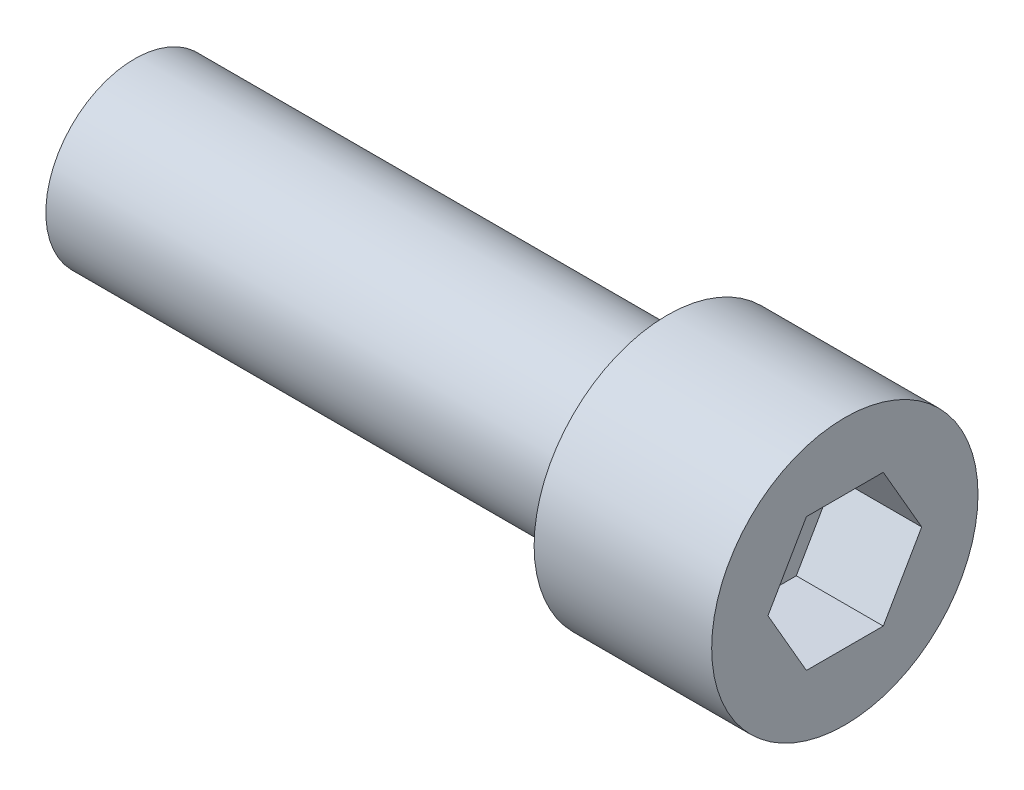
ISO-10303-21;
HEADER;
FILE_DESCRIPTION(('STEP AP214'),'2;1');
FILE_NAME('part.step','',(''),(''),'','','');
FILE_SCHEMA(('AUTOMOTIVE_DESIGN { 1 0 10303 214 1 1 1 1 }'));
ENDSEC;
DATA;
#1=APPLICATION_CONTEXT('core data for automotive mechanical design processes');
#2=APPLICATION_PROTOCOL_DEFINITION('international standard','automotive_design',2000,#1);
#3=PRODUCT_CONTEXT('',#1,'mechanical');
#4=PRODUCT('Part','Part','',(#3));
#5=PRODUCT_RELATED_PRODUCT_CATEGORY('part','',(#4));
#6=PRODUCT_DEFINITION_FORMATION('','',#4);
#7=PRODUCT_DEFINITION_CONTEXT('part definition',#1,'design');
#8=PRODUCT_DEFINITION('design','',#6,#7);
#9=PRODUCT_DEFINITION_SHAPE('','',#8);
#10=(LENGTH_UNIT() NAMED_UNIT(*) SI_UNIT(.MILLI.,.METRE.));
#11=(NAMED_UNIT(*) PLANE_ANGLE_UNIT() SI_UNIT($,.RADIAN.));
#12=(NAMED_UNIT(*) SI_UNIT($,.STERADIAN.) SOLID_ANGLE_UNIT());
#13=UNCERTAINTY_MEASURE_WITH_UNIT(LENGTH_MEASURE(1.E-05),#10,'distance_accuracy_value','');
#14=(GEOMETRIC_REPRESENTATION_CONTEXT(3) GLOBAL_UNCERTAINTY_ASSIGNED_CONTEXT((#13)) GLOBAL_UNIT_ASSIGNED_CONTEXT((#10,
#11,#12)) REPRESENTATION_CONTEXT('',''));
#15=CARTESIAN_POINT('',(0.,0.,0.));
#16=DIRECTION('',(0.,0.,1.));
#17=DIRECTION('',(1.,0.,0.));
#18=AXIS2_PLACEMENT_3D('',#15,#16,#17);
#19=CARTESIAN_POINT('',(-38.1,0.,0.));
#20=DIRECTION('',(1.,0.,0.));
#21=DIRECTION('',(0.,0.,-1.));
#22=AXIS2_PLACEMENT_3D('',#19,#20,#21);
#23=CYLINDRICAL_SURFACE('',#22,6.35);
#24=CARTESIAN_POINT('',(-38.1,0.,0.));
#25=DIRECTION('',(1.,0.,0.));
#26=DIRECTION('',(0.,0.,-1.));
#27=AXIS2_PLACEMENT_3D('',#24,#25,#26);
#28=CIRCLE('',#27,6.35);
#29=CARTESIAN_POINT('',(-38.1,0.,-6.35));
#30=VERTEX_POINT('',#29);
#31=EDGE_CURVE('E11',#30,#30,#28,.T.);
#32=ORIENTED_EDGE('',*,*,#31,.T.);
#33=EDGE_LOOP('',(#32));
#34=FACE_BOUND('',#33,.T.);
#35=CARTESIAN_POINT('',(0.,0.,0.));
#36=DIRECTION('',(1.,0.,0.));
#37=DIRECTION('',(0.,0.,-1.));
#38=AXIS2_PLACEMENT_3D('',#35,#36,#37);
#39=CIRCLE('',#38,6.35);
#40=CARTESIAN_POINT('',(0.,0.,-6.35));
#41=VERTEX_POINT('',#40);
#42=EDGE_CURVE('E43',#41,#41,#39,.T.);
#43=ORIENTED_EDGE('',*,*,#42,.F.);
#44=EDGE_LOOP('',(#43));
#45=FACE_BOUND('',#44,.T.);
#46=ADVANCED_FACE('F40',(#34,#45),#23,.T.);
#47=CARTESIAN_POINT('',(-38.1,0.,0.));
#48=DIRECTION('',(1.,0.,0.));
#49=DIRECTION('',(0.,0.,-1.));
#50=AXIS2_PLACEMENT_3D('',#47,#48,#49);
#51=PLANE('',#50);
#52=ORIENTED_EDGE('',*,*,#31,.F.);
#53=EDGE_LOOP('',(#52));
#54=FACE_BOUND('',#53,.T.);
#55=ADVANCED_FACE('F172',(#54),#51,.F.);
#56=CARTESIAN_POINT('',(12.7,0.,0.));
#57=DIRECTION('',(-1.,0.,0.));
#58=DIRECTION('',(0.,0.,1.));
#59=AXIS2_PLACEMENT_3D('',#56,#57,#58);
#60=CYLINDRICAL_SURFACE('',#59,9.525);
#61=CARTESIAN_POINT('',(12.7,0.,0.));
#62=DIRECTION('',(1.,0.,0.));
#63=DIRECTION('',(0.,0.,-1.));
#64=AXIS2_PLACEMENT_3D('',#61,#62,#63);
#65=CIRCLE('',#64,9.525);
#66=CARTESIAN_POINT('',(12.7,0.,-9.525));
#67=VERTEX_POINT('',#66);
#68=EDGE_CURVE('E147',#67,#67,#65,.T.);
#69=ORIENTED_EDGE('',*,*,#68,.F.);
#70=EDGE_LOOP('',(#69));
#71=FACE_BOUND('',#70,.T.);
#72=CARTESIAN_POINT('',(0.,0.,0.));
#73=DIRECTION('',(1.,0.,0.));
#74=DIRECTION('',(0.,0.,-1.));
#75=AXIS2_PLACEMENT_3D('',#72,#73,#74);
#76=CIRCLE('',#75,9.525);
#77=CARTESIAN_POINT('',(0.,0.,-9.525));
#78=VERTEX_POINT('',#77);
#79=EDGE_CURVE('E141',#78,#78,#76,.T.);
#80=ORIENTED_EDGE('',*,*,#79,.T.);
#81=EDGE_LOOP('',(#80));
#82=FACE_BOUND('',#81,.T.);
#83=ADVANCED_FACE('F153',(#71,#82),#60,.T.);
#84=CARTESIAN_POINT('',(12.7,0.,0.));
#85=DIRECTION('',(1.,0.,0.));
#86=DIRECTION('',(0.,0.,-1.));
#87=AXIS2_PLACEMENT_3D('',#84,#85,#86);
#88=PLANE('',#87);
#89=DIRECTION('',(0.,0.866025403784439,0.5));
#90=VECTOR('',#89,1.);
#91=CARTESIAN_POINT('',(12.7,0.,-5.49926131403119));
#92=LINE('',#91,#90);
#93=CARTESIAN_POINT('',(12.7,0.,-5.49926131403119));
#94=VERTEX_POINT('',#93);
#95=CARTESIAN_POINT('',(12.7,4.7625,-2.74963065701559));
#96=VERTEX_POINT('',#95);
#97=EDGE_CURVE('E54',#94,#96,#92,.T.);
#98=ORIENTED_EDGE('',*,*,#97,.F.);
#99=DIRECTION('',(0.,0.866025403784439,-0.5));
#100=VECTOR('',#99,1.);
#101=CARTESIAN_POINT('',(12.7,-4.7625,-2.74963065701559));
#102=LINE('',#101,#100);
#103=CARTESIAN_POINT('',(12.7,-4.7625,-2.74963065701559));
#104=VERTEX_POINT('',#103);
#105=EDGE_CURVE('E137',#104,#94,#102,.T.);
#106=ORIENTED_EDGE('',*,*,#105,.F.);
#107=DIRECTION('',(0.,0.,-1.));
#108=VECTOR('',#107,1.);
#109=CARTESIAN_POINT('',(12.7,-4.7625,2.74963065701559));
#110=LINE('',#109,#108);
#111=CARTESIAN_POINT('',(12.7,-4.7625,2.74963065701559));
#112=VERTEX_POINT('',#111);
#113=EDGE_CURVE('E135',#112,#104,#110,.T.);
#114=ORIENTED_EDGE('',*,*,#113,.F.);
#115=DIRECTION('',(0.,-0.866025403784439,-0.5));
#116=VECTOR('',#115,1.);
#117=CARTESIAN_POINT('',(12.7,0.,5.49926131403118));
#118=LINE('',#117,#116);
#119=CARTESIAN_POINT('',(12.7,0.,5.49926131403118));
#120=VERTEX_POINT('',#119);
#121=EDGE_CURVE('E102',#120,#112,#118,.T.);
#122=ORIENTED_EDGE('',*,*,#121,.F.);
#123=DIRECTION('',(0.,-0.866025403784439,0.5));
#124=VECTOR('',#123,1.);
#125=CARTESIAN_POINT('',(12.7,4.7625,2.74963065701559));
#126=LINE('',#125,#124);
#127=CARTESIAN_POINT('',(12.7,4.7625,2.74963065701559));
#128=VERTEX_POINT('',#127);
#129=EDGE_CURVE('E131',#128,#120,#126,.T.);
#130=ORIENTED_EDGE('',*,*,#129,.F.);
#131=DIRECTION('',(0.,0.,1.));
#132=VECTOR('',#131,1.);
#133=CARTESIAN_POINT('',(12.7,4.7625,-2.74963065701559));
#134=LINE('',#133,#132);
#135=EDGE_CURVE('E128',#96,#128,#134,.T.);
#136=ORIENTED_EDGE('',*,*,#135,.F.);
#137=EDGE_LOOP('',(#98,#106,#114,#122,#130,#136));
#138=FACE_BOUND('',#137,.T.);
#139=ORIENTED_EDGE('',*,*,#68,.T.);
#140=EDGE_LOOP('',(#139));
#141=FACE_BOUND('',#140,.T.);
#142=ADVANCED_FACE('F158',(#138,#141),#88,.T.);
#143=CARTESIAN_POINT('',(0.,0.,0.));
#144=DIRECTION('',(1.,0.,0.));
#145=DIRECTION('',(0.,0.,-1.));
#146=AXIS2_PLACEMENT_3D('',#143,#144,#145);
#147=PLANE('',#146);
#148=ORIENTED_EDGE('',*,*,#42,.T.);
#149=EDGE_LOOP('',(#148));
#150=FACE_BOUND('',#149,.T.);
#151=ORIENTED_EDGE('',*,*,#79,.F.);
#152=EDGE_LOOP('',(#151));
#153=FACE_BOUND('',#152,.T.);
#154=ADVANCED_FACE('F155',(#150,#153),#147,.F.);
#155=CARTESIAN_POINT('',(6.477,0.,-5.49926131403119));
#156=DIRECTION('',(0.,0.5,-0.866025403784438));
#157=DIRECTION('',(0.,0.866025403784439,0.5));
#158=AXIS2_PLACEMENT_3D('',#155,#156,#157);
#159=PLANE('',#158);
#160=ORIENTED_EDGE('',*,*,#97,.T.);
#161=DIRECTION('',(1.,0.,0.));
#162=VECTOR('',#161,1.);
#163=CARTESIAN_POINT('',(6.477,4.7625,-2.74963065701559));
#164=LINE('',#163,#162);
#165=CARTESIAN_POINT('',(6.477,4.7625,-2.74963065701559));
#166=VERTEX_POINT('',#165);
#167=EDGE_CURVE('E84',#166,#96,#164,.T.);
#168=ORIENTED_EDGE('',*,*,#167,.F.);
#169=DIRECTION('',(0.,0.866025403784439,0.5));
#170=VECTOR('',#169,1.);
#171=CARTESIAN_POINT('',(6.477,0.,-5.49926131403119));
#172=LINE('',#171,#170);
#173=CARTESIAN_POINT('',(6.477,0.,-5.49926131403119));
#174=VERTEX_POINT('',#173);
#175=EDGE_CURVE('E139',#174,#166,#172,.T.);
#176=ORIENTED_EDGE('',*,*,#175,.F.);
#177=DIRECTION('',(1.,0.,0.));
#178=VECTOR('',#177,1.);
#179=CARTESIAN_POINT('',(6.477,0.,-5.49926131403119));
#180=LINE('',#179,#178);
#181=EDGE_CURVE('E62',#174,#94,#180,.T.);
#182=ORIENTED_EDGE('',*,*,#181,.T.);
#183=EDGE_LOOP('',(#160,#168,#176,#182));
#184=FACE_BOUND('',#183,.T.);
#185=ADVANCED_FACE('F157',(#184),#159,.F.);
#186=CARTESIAN_POINT('',(6.477,-4.7625,-2.74963065701559));
#187=DIRECTION('',(0.,-0.5,-0.866025403784439));
#188=DIRECTION('',(0.,0.866025403784439,-0.5));
#189=AXIS2_PLACEMENT_3D('',#186,#187,#188);
#190=PLANE('',#189);
#191=ORIENTED_EDGE('',*,*,#105,.T.);
#192=ORIENTED_EDGE('',*,*,#181,.F.);
#193=DIRECTION('',(0.,0.866025403784439,-0.5));
#194=VECTOR('',#193,1.);
#195=CARTESIAN_POINT('',(6.477,-4.7625,-2.74963065701559));
#196=LINE('',#195,#194);
#197=CARTESIAN_POINT('',(6.477,-4.7625,-2.74963065701559));
#198=VERTEX_POINT('',#197);
#199=EDGE_CURVE('E114',#198,#174,#196,.T.);
#200=ORIENTED_EDGE('',*,*,#199,.F.);
#201=DIRECTION('',(1.,0.,0.));
#202=VECTOR('',#201,1.);
#203=CARTESIAN_POINT('',(6.477,-4.7625,-2.74963065701559));
#204=LINE('',#203,#202);
#205=EDGE_CURVE('E106',#198,#104,#204,.T.);
#206=ORIENTED_EDGE('',*,*,#205,.T.);
#207=EDGE_LOOP('',(#191,#192,#200,#206));
#208=FACE_BOUND('',#207,.T.);
#209=ADVANCED_FACE('F165',(#208),#190,.F.);
#210=CARTESIAN_POINT('',(6.477,-4.7625,2.74963065701559));
#211=DIRECTION('',(0.,-1.,0.));
#212=DIRECTION('',(0.,0.,-1.));
#213=AXIS2_PLACEMENT_3D('',#210,#211,#212);
#214=PLANE('',#213);
#215=ORIENTED_EDGE('',*,*,#113,.T.);
#216=ORIENTED_EDGE('',*,*,#205,.F.);
#217=DIRECTION('',(0.,0.,-1.));
#218=VECTOR('',#217,1.);
#219=CARTESIAN_POINT('',(6.477,-4.7625,2.74963065701559));
#220=LINE('',#219,#218);
#221=CARTESIAN_POINT('',(6.477,-4.7625,2.74963065701559));
#222=VERTEX_POINT('',#221);
#223=EDGE_CURVE('E110',#222,#198,#220,.T.);
#224=ORIENTED_EDGE('',*,*,#223,.F.);
#225=DIRECTION('',(1.,0.,0.));
#226=VECTOR('',#225,1.);
#227=CARTESIAN_POINT('',(6.477,-4.7625,2.74963065701559));
#228=LINE('',#227,#226);
#229=EDGE_CURVE('E95',#222,#112,#228,.T.);
#230=ORIENTED_EDGE('',*,*,#229,.T.);
#231=EDGE_LOOP('',(#215,#216,#224,#230));
#232=FACE_BOUND('',#231,.T.);
#233=ADVANCED_FACE('F111',(#232),#214,.F.);
#234=CARTESIAN_POINT('',(6.477,0.,5.49926131403118));
#235=DIRECTION('',(0.,-0.5,0.866025403784438));
#236=DIRECTION('',(0.,-0.866025403784439,-0.5));
#237=AXIS2_PLACEMENT_3D('',#234,#235,#236);
#238=PLANE('',#237);
#239=ORIENTED_EDGE('',*,*,#121,.T.);
#240=ORIENTED_EDGE('',*,*,#229,.F.);
#241=DIRECTION('',(0.,-0.866025403784439,-0.5));
#242=VECTOR('',#241,1.);
#243=CARTESIAN_POINT('',(6.477,0.,5.49926131403118));
#244=LINE('',#243,#242);
#245=CARTESIAN_POINT('',(6.477,0.,5.49926131403118));
#246=VERTEX_POINT('',#245);
#247=EDGE_CURVE('E99',#246,#222,#244,.T.);
#248=ORIENTED_EDGE('',*,*,#247,.F.);
#249=DIRECTION('',(1.,0.,0.));
#250=VECTOR('',#249,1.);
#251=CARTESIAN_POINT('',(6.477,0.,5.49926131403118));
#252=LINE('',#251,#250);
#253=EDGE_CURVE('E107',#246,#120,#252,.T.);
#254=ORIENTED_EDGE('',*,*,#253,.T.);
#255=EDGE_LOOP('',(#239,#240,#248,#254));
#256=FACE_BOUND('',#255,.T.);
#257=ADVANCED_FACE('F97',(#256),#238,.F.);
#258=CARTESIAN_POINT('',(6.477,4.7625,2.74963065701559));
#259=DIRECTION('',(0.,0.5,0.866025403784438));
#260=DIRECTION('',(0.,-0.866025403784439,0.5));
#261=AXIS2_PLACEMENT_3D('',#258,#259,#260);
#262=PLANE('',#261);
#263=ORIENTED_EDGE('',*,*,#129,.T.);
#264=ORIENTED_EDGE('',*,*,#253,.F.);
#265=DIRECTION('',(0.,-0.866025403784439,0.5));
#266=VECTOR('',#265,1.);
#267=CARTESIAN_POINT('',(6.477,4.7625,2.74963065701559));
#268=LINE('',#267,#266);
#269=CARTESIAN_POINT('',(6.477,4.7625,2.74963065701559));
#270=VERTEX_POINT('',#269);
#271=EDGE_CURVE('E120',#270,#246,#268,.T.);
#272=ORIENTED_EDGE('',*,*,#271,.F.);
#273=DIRECTION('',(1.,0.,0.));
#274=VECTOR('',#273,1.);
#275=CARTESIAN_POINT('',(6.477,4.7625,2.74963065701559));
#276=LINE('',#275,#274);
#277=EDGE_CURVE('E144',#270,#128,#276,.T.);
#278=ORIENTED_EDGE('',*,*,#277,.T.);
#279=EDGE_LOOP('',(#263,#264,#272,#278));
#280=FACE_BOUND('',#279,.T.);
#281=ADVANCED_FACE('F227',(#280),#262,.F.);
#282=CARTESIAN_POINT('',(6.477,4.7625,-2.74963065701559));
#283=DIRECTION('',(0.,1.,0.));
#284=DIRECTION('',(0.,0.,1.));
#285=AXIS2_PLACEMENT_3D('',#282,#283,#284);
#286=PLANE('',#285);
#287=ORIENTED_EDGE('',*,*,#135,.T.);
#288=ORIENTED_EDGE('',*,*,#277,.F.);
#289=DIRECTION('',(0.,0.,1.));
#290=VECTOR('',#289,1.);
#291=CARTESIAN_POINT('',(6.477,4.7625,-2.74963065701559));
#292=LINE('',#291,#290);
#293=EDGE_CURVE('E122',#166,#270,#292,.T.);
#294=ORIENTED_EDGE('',*,*,#293,.F.);
#295=ORIENTED_EDGE('',*,*,#167,.T.);
#296=EDGE_LOOP('',(#287,#288,#294,#295));
#297=FACE_BOUND('',#296,.T.);
#298=ADVANCED_FACE('F236',(#297),#286,.F.);
#299=CARTESIAN_POINT('',(6.477,0.,0.));
#300=DIRECTION('',(1.,0.,0.));
#301=DIRECTION('',(0.,0.,-1.));
#302=AXIS2_PLACEMENT_3D('',#299,#300,#301);
#303=PLANE('',#302);
#304=ORIENTED_EDGE('',*,*,#175,.T.);
#305=ORIENTED_EDGE('',*,*,#293,.T.);
#306=ORIENTED_EDGE('',*,*,#271,.T.);
#307=ORIENTED_EDGE('',*,*,#247,.T.);
#308=ORIENTED_EDGE('',*,*,#223,.T.);
#309=ORIENTED_EDGE('',*,*,#199,.T.);
#310=EDGE_LOOP('',(#304,#305,#306,#307,#308,#309));
#311=FACE_BOUND('',#310,.T.);
#312=ADVANCED_FACE('F117',(#311),#303,.T.);
#313=CLOSED_SHELL('',(#46,#55,#83,#142,#154,#185,#209,#233,#257,#281,#298,#312));
#314=MANIFOLD_SOLID_BREP('B2',#313);
#315=ADVANCED_BREP_SHAPE_REPRESENTATION('',(#18,#314),#14);
#316=SHAPE_DEFINITION_REPRESENTATION(#9,#315);
ENDSEC;
END-ISO-10303-21;
